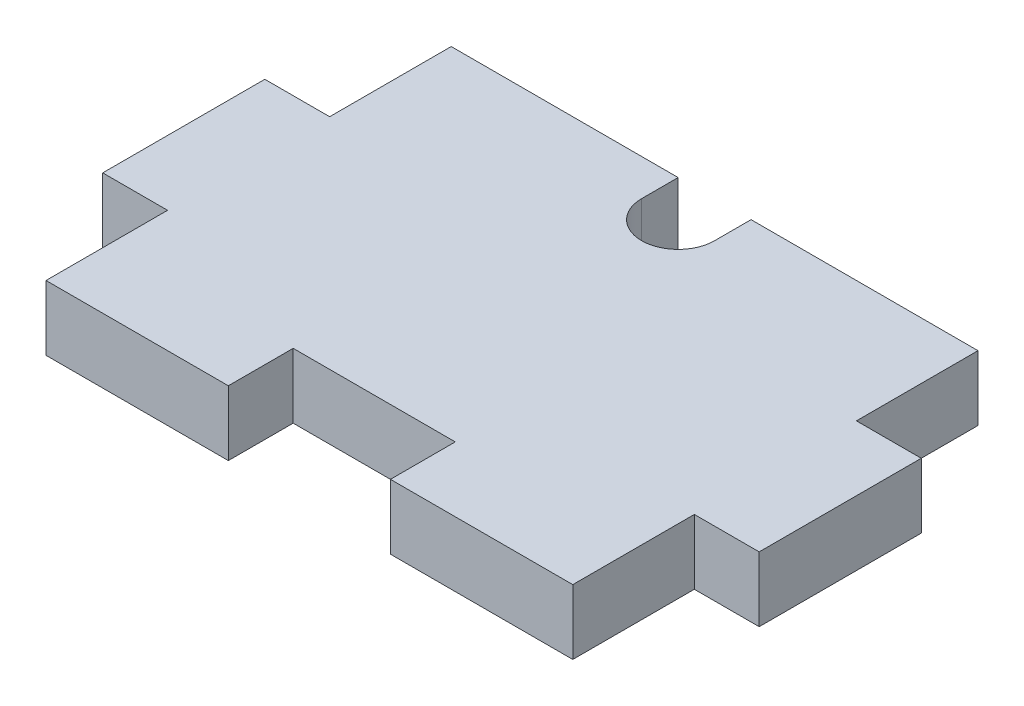
ISO-10303-21;
HEADER;
FILE_DESCRIPTION(('STEP AP214'),'2;1');
FILE_NAME('part.step','',(''),(''),'','','');
FILE_SCHEMA(('AUTOMOTIVE_DESIGN { 1 0 10303 214 1 1 1 1 }'));
ENDSEC;
DATA;
#1=APPLICATION_CONTEXT('core data for automotive mechanical design processes');
#2=APPLICATION_PROTOCOL_DEFINITION('international standard','automotive_design',2000,#1);
#3=PRODUCT_CONTEXT('',#1,'mechanical');
#4=PRODUCT('Part','Part','',(#3));
#5=PRODUCT_RELATED_PRODUCT_CATEGORY('part','',(#4));
#6=PRODUCT_DEFINITION_FORMATION('','',#4);
#7=PRODUCT_DEFINITION_CONTEXT('part definition',#1,'design');
#8=PRODUCT_DEFINITION('design','',#6,#7);
#9=PRODUCT_DEFINITION_SHAPE('','',#8);
#10=(LENGTH_UNIT() NAMED_UNIT(*) SI_UNIT(.MILLI.,.METRE.));
#11=(NAMED_UNIT(*) PLANE_ANGLE_UNIT() SI_UNIT($,.RADIAN.));
#12=(NAMED_UNIT(*) SI_UNIT($,.STERADIAN.) SOLID_ANGLE_UNIT());
#13=UNCERTAINTY_MEASURE_WITH_UNIT(LENGTH_MEASURE(1.E-05),#10,'distance_accuracy_value','');
#14=(GEOMETRIC_REPRESENTATION_CONTEXT(3) GLOBAL_UNCERTAINTY_ASSIGNED_CONTEXT((#13)) GLOBAL_UNIT_ASSIGNED_CONTEXT((#10,
#11,#12)) REPRESENTATION_CONTEXT('',''));
#15=CARTESIAN_POINT('',(0.,0.,0.));
#16=DIRECTION('',(0.,0.,1.));
#17=DIRECTION('',(1.,0.,0.));
#18=AXIS2_PLACEMENT_3D('',#15,#16,#17);
#19=CARTESIAN_POINT('',(0.,4.,25.));
#20=DIRECTION('',(0.,0.,-1.));
#21=DIRECTION('',(-1.,0.,0.));
#22=AXIS2_PLACEMENT_3D('',#19,#20,#21);
#23=PLANE('',#22);
#24=DIRECTION('',(1.,0.,0.));
#25=VECTOR('',#24,1.);
#26=CARTESIAN_POINT('',(0.,0.,25.));
#27=LINE('',#26,#25);
#28=CARTESIAN_POINT('',(0.,0.,25.));
#29=VERTEX_POINT('',#28);
#30=CARTESIAN_POINT('',(11.25,0.,25.));
#31=VERTEX_POINT('',#30);
#32=EDGE_CURVE('E188',#29,#31,#27,.T.);
#33=ORIENTED_EDGE('',*,*,#32,.T.);
#34=DIRECTION('',(0.,1.,0.));
#35=VECTOR('',#34,1.);
#36=CARTESIAN_POINT('',(11.25,0.,25.));
#37=LINE('',#36,#35);
#38=CARTESIAN_POINT('',(11.25,4.,25.));
#39=VERTEX_POINT('',#38);
#40=EDGE_CURVE('E170',#31,#39,#37,.T.);
#41=ORIENTED_EDGE('',*,*,#40,.T.);
#42=DIRECTION('',(1.,0.,0.));
#43=VECTOR('',#42,1.);
#44=CARTESIAN_POINT('',(0.,4.,25.));
#45=LINE('',#44,#43);
#46=CARTESIAN_POINT('',(0.,4.,25.));
#47=VERTEX_POINT('',#46);
#48=EDGE_CURVE('E309',#47,#39,#45,.T.);
#49=ORIENTED_EDGE('',*,*,#48,.F.);
#50=DIRECTION('',(0.,-1.,0.));
#51=VECTOR('',#50,1.);
#52=CARTESIAN_POINT('',(0.,4.,25.));
#53=LINE('',#52,#51);
#54=EDGE_CURVE('E11',#47,#29,#53,.T.);
#55=ORIENTED_EDGE('',*,*,#54,.T.);
#56=EDGE_LOOP('',(#33,#41,#49,#55));
#57=FACE_BOUND('',#56,.T.);
#58=ADVANCED_FACE('F33',(#57),#23,.F.);
#59=CARTESIAN_POINT('',(32.5,4.,0.));
#60=DIRECTION('',(-1.,0.,0.));
#61=DIRECTION('',(0.,0.,1.));
#62=AXIS2_PLACEMENT_3D('',#59,#60,#61);
#63=PLANE('',#62);
#64=DIRECTION('',(0.,1.,0.));
#65=VECTOR('',#64,1.);
#66=CARTESIAN_POINT('',(32.5,0.,7.5));
#67=LINE('',#66,#65);
#68=CARTESIAN_POINT('',(32.5,0.,7.5));
#69=VERTEX_POINT('',#68);
#70=CARTESIAN_POINT('',(32.5,4.,7.5));
#71=VERTEX_POINT('',#70);
#72=EDGE_CURVE('E235',#69,#71,#67,.T.);
#73=ORIENTED_EDGE('',*,*,#72,.F.);
#74=DIRECTION('',(0.,0.,-1.));
#75=VECTOR('',#74,1.);
#76=CARTESIAN_POINT('',(32.5,0.,0.));
#77=LINE('',#76,#75);
#78=CARTESIAN_POINT('',(32.5,0.,0.));
#79=VERTEX_POINT('',#78);
#80=EDGE_CURVE('E193',#69,#79,#77,.T.);
#81=ORIENTED_EDGE('',*,*,#80,.T.);
#82=DIRECTION('',(0.,-1.,0.));
#83=VECTOR('',#82,1.);
#84=CARTESIAN_POINT('',(32.5,4.,0.));
#85=LINE('',#84,#83);
#86=CARTESIAN_POINT('',(32.5,4.,0.));
#87=VERTEX_POINT('',#86);
#88=EDGE_CURVE('E211',#87,#79,#85,.T.);
#89=ORIENTED_EDGE('',*,*,#88,.F.);
#90=DIRECTION('',(0.,0.,-1.));
#91=VECTOR('',#90,1.);
#92=CARTESIAN_POINT('',(32.5,4.,0.));
#93=LINE('',#92,#91);
#94=EDGE_CURVE('E311',#71,#87,#93,.T.);
#95=ORIENTED_EDGE('',*,*,#94,.F.);
#96=EDGE_LOOP('',(#73,#81,#89,#95));
#97=FACE_BOUND('',#96,.T.);
#98=ADVANCED_FACE('F376',(#97),#63,.F.);
#99=CARTESIAN_POINT('',(0.,4.,0.));
#100=DIRECTION('',(1.,0.,0.));
#101=DIRECTION('',(0.,0.,-1.));
#102=AXIS2_PLACEMENT_3D('',#99,#100,#101);
#103=PLANE('',#102);
#104=DIRECTION('',(0.,1.,0.));
#105=VECTOR('',#104,1.);
#106=CARTESIAN_POINT('',(0.,0.,17.5));
#107=LINE('',#106,#105);
#108=CARTESIAN_POINT('',(0.,0.,17.5));
#109=VERTEX_POINT('',#108);
#110=CARTESIAN_POINT('',(0.,4.,17.5));
#111=VERTEX_POINT('',#110);
#112=EDGE_CURVE('E271',#109,#111,#107,.T.);
#113=ORIENTED_EDGE('',*,*,#112,.F.);
#114=DIRECTION('',(0.,0.,1.));
#115=VECTOR('',#114,1.);
#116=CARTESIAN_POINT('',(0.,0.,0.));
#117=LINE('',#116,#115);
#118=EDGE_CURVE('E298',#109,#29,#117,.T.);
#119=ORIENTED_EDGE('',*,*,#118,.T.);
#120=ORIENTED_EDGE('',*,*,#54,.F.);
#121=DIRECTION('',(0.,0.,1.));
#122=VECTOR('',#121,1.);
#123=CARTESIAN_POINT('',(0.,4.,0.));
#124=LINE('',#123,#122);
#125=EDGE_CURVE('E207',#111,#47,#124,.T.);
#126=ORIENTED_EDGE('',*,*,#125,.F.);
#127=EDGE_LOOP('',(#113,#119,#120,#126));
#128=FACE_BOUND('',#127,.T.);
#129=ADVANCED_FACE('F344',(#128),#103,.F.);
#130=CARTESIAN_POINT('',(0.,4.,0.));
#131=DIRECTION('',(0.,0.,1.));
#132=DIRECTION('',(1.,0.,0.));
#133=AXIS2_PLACEMENT_3D('',#130,#131,#132);
#134=PLANE('',#133);
#135=DIRECTION('',(0.,1.,0.));
#136=VECTOR('',#135,1.);
#137=CARTESIAN_POINT('',(14.,0.,0.));
#138=LINE('',#137,#136);
#139=CARTESIAN_POINT('',(14.,0.,0.));
#140=VERTEX_POINT('',#139);
#141=CARTESIAN_POINT('',(14.,4.,0.));
#142=VERTEX_POINT('',#141);
#143=EDGE_CURVE('E299',#140,#142,#138,.T.);
#144=ORIENTED_EDGE('',*,*,#143,.F.);
#145=DIRECTION('',(-1.,0.,0.));
#146=VECTOR('',#145,1.);
#147=CARTESIAN_POINT('',(0.,0.,0.));
#148=LINE('',#147,#146);
#149=CARTESIAN_POINT('',(0.,0.,0.));
#150=VERTEX_POINT('',#149);
#151=EDGE_CURVE('E203',#140,#150,#148,.T.);
#152=ORIENTED_EDGE('',*,*,#151,.T.);
#153=DIRECTION('',(0.,-1.,0.));
#154=VECTOR('',#153,1.);
#155=CARTESIAN_POINT('',(0.,4.,0.));
#156=LINE('',#155,#154);
#157=CARTESIAN_POINT('',(0.,4.,0.));
#158=VERTEX_POINT('',#157);
#159=EDGE_CURVE('E208',#158,#150,#156,.T.);
#160=ORIENTED_EDGE('',*,*,#159,.F.);
#161=DIRECTION('',(-1.,0.,0.));
#162=VECTOR('',#161,1.);
#163=CARTESIAN_POINT('',(0.,4.,0.));
#164=LINE('',#163,#162);
#165=EDGE_CURVE('E312',#142,#158,#164,.T.);
#166=ORIENTED_EDGE('',*,*,#165,.F.);
#167=EDGE_LOOP('',(#144,#152,#160,#166));
#168=FACE_BOUND('',#167,.T.);
#169=ADVANCED_FACE('F325',(#168),#134,.F.);
#170=CARTESIAN_POINT('',(0.,4.,0.));
#171=DIRECTION('',(0.,1.,0.));
#172=DIRECTION('',(0.,0.,1.));
#173=AXIS2_PLACEMENT_3D('',#170,#171,#172);
#174=PLANE('',#173);
#175=DIRECTION('',(0.,0.,1.));
#176=VECTOR('',#175,1.);
#177=CARTESIAN_POINT('',(11.25,4.,21.));
#178=LINE('',#177,#176);
#179=CARTESIAN_POINT('',(11.25,4.,21.));
#180=VERTEX_POINT('',#179);
#181=EDGE_CURVE('E176',#180,#39,#178,.T.);
#182=ORIENTED_EDGE('',*,*,#181,.F.);
#183=DIRECTION('',(-1.,0.,0.));
#184=VECTOR('',#183,1.);
#185=CARTESIAN_POINT('',(11.25,4.,21.));
#186=LINE('',#185,#184);
#187=CARTESIAN_POINT('',(21.25,4.,21.));
#188=VERTEX_POINT('',#187);
#189=EDGE_CURVE('E190',#188,#180,#186,.T.);
#190=ORIENTED_EDGE('',*,*,#189,.F.);
#191=DIRECTION('',(0.,0.,-1.));
#192=VECTOR('',#191,1.);
#193=CARTESIAN_POINT('',(21.25,4.,21.));
#194=LINE('',#193,#192);
#195=CARTESIAN_POINT('',(21.25,4.,25.));
#196=VERTEX_POINT('',#195);
#197=EDGE_CURVE('E348',#196,#188,#194,.T.);
#198=ORIENTED_EDGE('',*,*,#197,.F.);
#199=CARTESIAN_POINT('',(32.5,4.,25.));
#200=VERTEX_POINT('',#199);
#201=EDGE_CURVE('E308',#196,#200,#45,.T.);
#202=ORIENTED_EDGE('',*,*,#201,.T.);
#203=CARTESIAN_POINT('',(32.5,4.,17.5));
#204=VERTEX_POINT('',#203);
#205=EDGE_CURVE('E221',#200,#204,#93,.T.);
#206=ORIENTED_EDGE('',*,*,#205,.T.);
#207=DIRECTION('',(1.,0.,0.));
#208=VECTOR('',#207,1.);
#209=CARTESIAN_POINT('',(32.5,4.,17.5));
#210=LINE('',#209,#208);
#211=CARTESIAN_POINT('',(36.5,4.,17.5));
#212=VERTEX_POINT('',#211);
#213=EDGE_CURVE('E56',#204,#212,#210,.T.);
#214=ORIENTED_EDGE('',*,*,#213,.T.);
#215=DIRECTION('',(0.,0.,-1.));
#216=VECTOR('',#215,1.);
#217=CARTESIAN_POINT('',(36.5,4.,7.5));
#218=LINE('',#217,#216);
#219=CARTESIAN_POINT('',(36.5,4.,7.5));
#220=VERTEX_POINT('',#219);
#221=EDGE_CURVE('E240',#212,#220,#218,.T.);
#222=ORIENTED_EDGE('',*,*,#221,.T.);
#223=DIRECTION('',(-1.,0.,0.));
#224=VECTOR('',#223,1.);
#225=CARTESIAN_POINT('',(32.5,4.,7.5));
#226=LINE('',#225,#224);
#227=EDGE_CURVE('E243',#220,#71,#226,.T.);
#228=ORIENTED_EDGE('',*,*,#227,.T.);
#229=ORIENTED_EDGE('',*,*,#94,.T.);
#230=CARTESIAN_POINT('',(18.5,4.,0.));
#231=VERTEX_POINT('',#230);
#232=EDGE_CURVE('E212',#87,#231,#164,.T.);
#233=ORIENTED_EDGE('',*,*,#232,.T.);
#234=DIRECTION('',(0.,0.,-1.));
#235=VECTOR('',#234,1.);
#236=CARTESIAN_POINT('',(18.5,4.,0.));
#237=LINE('',#236,#235);
#238=CARTESIAN_POINT('',(18.5,4.,2.25));
#239=VERTEX_POINT('',#238);
#240=EDGE_CURVE('E292',#239,#231,#237,.T.);
#241=ORIENTED_EDGE('',*,*,#240,.F.);
#242=CARTESIAN_POINT('',(16.25,4.,2.25));
#243=DIRECTION('',(0.,1.,0.));
#244=DIRECTION('',(0.,0.,1.));
#245=AXIS2_PLACEMENT_3D('',#242,#243,#244);
#246=CIRCLE('',#245,2.25);
#247=CARTESIAN_POINT('',(14.,4.,2.25));
#248=VERTEX_POINT('',#247);
#249=EDGE_CURVE('E273',#248,#239,#246,.T.);
#250=ORIENTED_EDGE('',*,*,#249,.F.);
#251=DIRECTION('',(0.,0.,-1.));
#252=VECTOR('',#251,1.);
#253=CARTESIAN_POINT('',(14.,4.,0.));
#254=LINE('',#253,#252);
#255=EDGE_CURVE('E284',#248,#142,#254,.T.);
#256=ORIENTED_EDGE('',*,*,#255,.T.);
#257=ORIENTED_EDGE('',*,*,#165,.T.);
#258=CARTESIAN_POINT('',(0.,4.,7.5));
#259=VERTEX_POINT('',#258);
#260=EDGE_CURVE('E305',#158,#259,#124,.T.);
#261=ORIENTED_EDGE('',*,*,#260,.T.);
#262=DIRECTION('',(-1.,0.,0.));
#263=VECTOR('',#262,1.);
#264=CARTESIAN_POINT('',(-4.,4.,7.5));
#265=LINE('',#264,#263);
#266=CARTESIAN_POINT('',(-4.,4.,7.5));
#267=VERTEX_POINT('',#266);
#268=EDGE_CURVE('E250',#259,#267,#265,.T.);
#269=ORIENTED_EDGE('',*,*,#268,.T.);
#270=DIRECTION('',(0.,0.,1.));
#271=VECTOR('',#270,1.);
#272=CARTESIAN_POINT('',(-4.,4.,7.5));
#273=LINE('',#272,#271);
#274=CARTESIAN_POINT('',(-4.,4.,17.5));
#275=VERTEX_POINT('',#274);
#276=EDGE_CURVE('E266',#267,#275,#273,.T.);
#277=ORIENTED_EDGE('',*,*,#276,.T.);
#278=DIRECTION('',(1.,0.,0.));
#279=VECTOR('',#278,1.);
#280=CARTESIAN_POINT('',(-4.,4.,17.5));
#281=LINE('',#280,#279);
#282=EDGE_CURVE('E258',#275,#111,#281,.T.);
#283=ORIENTED_EDGE('',*,*,#282,.T.);
#284=ORIENTED_EDGE('',*,*,#125,.T.);
#285=ORIENTED_EDGE('',*,*,#48,.T.);
#286=EDGE_LOOP('',(#182,#190,#198,#202,#206,#214,#222,#228,#229,#233,#241,#250,#256,#257,#261,
#269,#277,#283,#284,#285));
#287=FACE_BOUND('',#286,.T.);
#288=ADVANCED_FACE('F319',(#287),#174,.T.);
#289=CARTESIAN_POINT('',(0.,0.,0.));
#290=DIRECTION('',(0.,1.,0.));
#291=DIRECTION('',(0.,0.,1.));
#292=AXIS2_PLACEMENT_3D('',#289,#290,#291);
#293=PLANE('',#292);
#294=DIRECTION('',(-1.,0.,0.));
#295=VECTOR('',#294,1.);
#296=CARTESIAN_POINT('',(11.25,0.,21.));
#297=LINE('',#296,#295);
#298=CARTESIAN_POINT('',(21.25,0.,21.));
#299=VERTEX_POINT('',#298);
#300=CARTESIAN_POINT('',(11.25,0.,21.));
#301=VERTEX_POINT('',#300);
#302=EDGE_CURVE('E182',#299,#301,#297,.T.);
#303=ORIENTED_EDGE('',*,*,#302,.T.);
#304=DIRECTION('',(0.,0.,1.));
#305=VECTOR('',#304,1.);
#306=CARTESIAN_POINT('',(11.25,0.,21.));
#307=LINE('',#306,#305);
#308=EDGE_CURVE('E173',#301,#31,#307,.T.);
#309=ORIENTED_EDGE('',*,*,#308,.T.);
#310=ORIENTED_EDGE('',*,*,#32,.F.);
#311=ORIENTED_EDGE('',*,*,#118,.F.);
#312=DIRECTION('',(1.,0.,0.));
#313=VECTOR('',#312,1.);
#314=CARTESIAN_POINT('',(-4.,0.,17.5));
#315=LINE('',#314,#313);
#316=CARTESIAN_POINT('',(-4.,0.,17.5));
#317=VERTEX_POINT('',#316);
#318=EDGE_CURVE('E261',#317,#109,#315,.T.);
#319=ORIENTED_EDGE('',*,*,#318,.F.);
#320=DIRECTION('',(0.,0.,1.));
#321=VECTOR('',#320,1.);
#322=CARTESIAN_POINT('',(-4.,0.,7.5));
#323=LINE('',#322,#321);
#324=CARTESIAN_POINT('',(-4.,0.,7.5));
#325=VERTEX_POINT('',#324);
#326=EDGE_CURVE('E257',#325,#317,#323,.T.);
#327=ORIENTED_EDGE('',*,*,#326,.F.);
#328=DIRECTION('',(-1.,0.,0.));
#329=VECTOR('',#328,1.);
#330=CARTESIAN_POINT('',(-4.,0.,7.5));
#331=LINE('',#330,#329);
#332=CARTESIAN_POINT('',(0.,0.,7.5));
#333=VERTEX_POINT('',#332);
#334=EDGE_CURVE('E254',#333,#325,#331,.T.);
#335=ORIENTED_EDGE('',*,*,#334,.F.);
#336=EDGE_CURVE('E198',#150,#333,#117,.T.);
#337=ORIENTED_EDGE('',*,*,#336,.F.);
#338=ORIENTED_EDGE('',*,*,#151,.F.);
#339=DIRECTION('',(0.,0.,-1.));
#340=VECTOR('',#339,1.);
#341=CARTESIAN_POINT('',(14.,0.,0.));
#342=LINE('',#341,#340);
#343=CARTESIAN_POINT('',(14.,0.,2.25));
#344=VERTEX_POINT('',#343);
#345=EDGE_CURVE('E287',#344,#140,#342,.T.);
#346=ORIENTED_EDGE('',*,*,#345,.F.);
#347=CARTESIAN_POINT('',(16.25,0.,2.25));
#348=DIRECTION('',(0.,1.,0.));
#349=DIRECTION('',(0.,0.,1.));
#350=AXIS2_PLACEMENT_3D('',#347,#348,#349);
#351=CIRCLE('',#350,2.25);
#352=CARTESIAN_POINT('',(18.5,0.,2.25));
#353=VERTEX_POINT('',#352);
#354=EDGE_CURVE('E280',#344,#353,#351,.T.);
#355=ORIENTED_EDGE('',*,*,#354,.T.);
#356=DIRECTION('',(0.,0.,-1.));
#357=VECTOR('',#356,1.);
#358=CARTESIAN_POINT('',(18.5,0.,0.));
#359=LINE('',#358,#357);
#360=CARTESIAN_POINT('',(18.5,0.,0.));
#361=VERTEX_POINT('',#360);
#362=EDGE_CURVE('E283',#353,#361,#359,.T.);
#363=ORIENTED_EDGE('',*,*,#362,.T.);
#364=EDGE_CURVE('E204',#79,#361,#148,.T.);
#365=ORIENTED_EDGE('',*,*,#364,.F.);
#366=ORIENTED_EDGE('',*,*,#80,.F.);
#367=DIRECTION('',(-1.,0.,0.));
#368=VECTOR('',#367,1.);
#369=CARTESIAN_POINT('',(32.5,0.,7.5));
#370=LINE('',#369,#368);
#371=CARTESIAN_POINT('',(36.5,0.,7.5));
#372=VERTEX_POINT('',#371);
#373=EDGE_CURVE('E233',#372,#69,#370,.T.);
#374=ORIENTED_EDGE('',*,*,#373,.F.);
#375=DIRECTION('',(0.,0.,-1.));
#376=VECTOR('',#375,1.);
#377=CARTESIAN_POINT('',(36.5,0.,7.5));
#378=LINE('',#377,#376);
#379=CARTESIAN_POINT('',(36.5,0.,17.5));
#380=VERTEX_POINT('',#379);
#381=EDGE_CURVE('E231',#380,#372,#378,.T.);
#382=ORIENTED_EDGE('',*,*,#381,.F.);
#383=DIRECTION('',(1.,0.,0.));
#384=VECTOR('',#383,1.);
#385=CARTESIAN_POINT('',(32.5,0.,17.5));
#386=LINE('',#385,#384);
#387=CARTESIAN_POINT('',(32.5,0.,17.5));
#388=VERTEX_POINT('',#387);
#389=EDGE_CURVE('E228',#388,#380,#386,.T.);
#390=ORIENTED_EDGE('',*,*,#389,.F.);
#391=CARTESIAN_POINT('',(32.5,0.,25.));
#392=VERTEX_POINT('',#391);
#393=EDGE_CURVE('E196',#392,#388,#77,.T.);
#394=ORIENTED_EDGE('',*,*,#393,.F.);
#395=CARTESIAN_POINT('',(21.25,0.,25.));
#396=VERTEX_POINT('',#395);
#397=EDGE_CURVE('E194',#396,#392,#27,.T.);
#398=ORIENTED_EDGE('',*,*,#397,.F.);
#399=DIRECTION('',(0.,0.,-1.));
#400=VECTOR('',#399,1.);
#401=CARTESIAN_POINT('',(21.25,0.,21.));
#402=LINE('',#401,#400);
#403=EDGE_CURVE('E48',#396,#299,#402,.T.);
#404=ORIENTED_EDGE('',*,*,#403,.T.);
#405=EDGE_LOOP('',(#303,#309,#310,#311,#319,#327,#335,#337,#338,#346,#355,#363,#365,#366,#374,
#382,#390,#394,#398,#404));
#406=FACE_BOUND('',#405,.T.);
#407=ADVANCED_FACE('F186',(#406),#293,.F.);
#408=ORIENTED_EDGE('',*,*,#336,.T.);
#409=DIRECTION('',(0.,1.,0.));
#410=VECTOR('',#409,1.);
#411=CARTESIAN_POINT('',(0.,0.,7.5));
#412=LINE('',#411,#410);
#413=EDGE_CURVE('E263',#333,#259,#412,.T.);
#414=ORIENTED_EDGE('',*,*,#413,.T.);
#415=ORIENTED_EDGE('',*,*,#260,.F.);
#416=ORIENTED_EDGE('',*,*,#159,.T.);
#417=EDGE_LOOP('',(#408,#414,#415,#416));
#418=FACE_BOUND('',#417,.T.);
#419=ADVANCED_FACE('F35',(#418),#103,.F.);
#420=ORIENTED_EDGE('',*,*,#201,.F.);
#421=DIRECTION('',(0.,1.,0.));
#422=VECTOR('',#421,1.);
#423=CARTESIAN_POINT('',(21.25,0.,25.));
#424=LINE('',#423,#422);
#425=EDGE_CURVE('E181',#396,#196,#424,.T.);
#426=ORIENTED_EDGE('',*,*,#425,.F.);
#427=ORIENTED_EDGE('',*,*,#397,.T.);
#428=DIRECTION('',(0.,-1.,0.));
#429=VECTOR('',#428,1.);
#430=CARTESIAN_POINT('',(32.5,4.,25.));
#431=LINE('',#430,#429);
#432=EDGE_CURVE('E41',#200,#392,#431,.T.);
#433=ORIENTED_EDGE('',*,*,#432,.F.);
#434=EDGE_LOOP('',(#420,#426,#427,#433));
#435=FACE_BOUND('',#434,.T.);
#436=ADVANCED_FACE('F377',(#435),#23,.F.);
#437=ORIENTED_EDGE('',*,*,#393,.T.);
#438=DIRECTION('',(0.,1.,0.));
#439=VECTOR('',#438,1.);
#440=CARTESIAN_POINT('',(32.5,0.,17.5));
#441=LINE('',#440,#439);
#442=EDGE_CURVE('E251',#388,#204,#441,.T.);
#443=ORIENTED_EDGE('',*,*,#442,.T.);
#444=ORIENTED_EDGE('',*,*,#205,.F.);
#445=ORIENTED_EDGE('',*,*,#432,.T.);
#446=EDGE_LOOP('',(#437,#443,#444,#445));
#447=FACE_BOUND('',#446,.T.);
#448=ADVANCED_FACE('F219',(#447),#63,.F.);
#449=ORIENTED_EDGE('',*,*,#364,.T.);
#450=DIRECTION('',(0.,1.,0.));
#451=VECTOR('',#450,1.);
#452=CARTESIAN_POINT('',(18.5,0.,0.));
#453=LINE('',#452,#451);
#454=EDGE_CURVE('E301',#361,#231,#453,.T.);
#455=ORIENTED_EDGE('',*,*,#454,.T.);
#456=ORIENTED_EDGE('',*,*,#232,.F.);
#457=ORIENTED_EDGE('',*,*,#88,.T.);
#458=EDGE_LOOP('',(#449,#455,#456,#457));
#459=FACE_BOUND('',#458,.T.);
#460=ADVANCED_FACE('F391',(#459),#134,.F.);
#461=CARTESIAN_POINT('',(16.25,0.,2.25));
#462=DIRECTION('',(0.,1.,0.));
#463=DIRECTION('',(0.,0.,1.));
#464=AXIS2_PLACEMENT_3D('',#461,#462,#463);
#465=CYLINDRICAL_SURFACE('',#464,2.25);
#466=ORIENTED_EDGE('',*,*,#249,.T.);
#467=DIRECTION('',(0.,1.,0.));
#468=VECTOR('',#467,1.);
#469=CARTESIAN_POINT('',(18.5,0.,2.25));
#470=LINE('',#469,#468);
#471=EDGE_CURVE('E289',#353,#239,#470,.T.);
#472=ORIENTED_EDGE('',*,*,#471,.F.);
#473=ORIENTED_EDGE('',*,*,#354,.F.);
#474=DIRECTION('',(0.,1.,0.));
#475=VECTOR('',#474,1.);
#476=CARTESIAN_POINT('',(14.,0.,2.25));
#477=LINE('',#476,#475);
#478=EDGE_CURVE('E296',#344,#248,#477,.T.);
#479=ORIENTED_EDGE('',*,*,#478,.T.);
#480=EDGE_LOOP('',(#466,#472,#473,#479));
#481=FACE_BOUND('',#480,.T.);
#482=ADVANCED_FACE('F482',(#481),#465,.F.);
#483=CARTESIAN_POINT('',(14.,0.,0.));
#484=DIRECTION('',(1.,0.,0.));
#485=DIRECTION('',(0.,0.,-1.));
#486=AXIS2_PLACEMENT_3D('',#483,#484,#485);
#487=PLANE('',#486);
#488=ORIENTED_EDGE('',*,*,#255,.F.);
#489=ORIENTED_EDGE('',*,*,#478,.F.);
#490=ORIENTED_EDGE('',*,*,#345,.T.);
#491=ORIENTED_EDGE('',*,*,#143,.T.);
#492=EDGE_LOOP('',(#488,#489,#490,#491));
#493=FACE_BOUND('',#492,.T.);
#494=ADVANCED_FACE('F472',(#493),#487,.T.);
#495=CARTESIAN_POINT('',(18.5,0.,0.));
#496=DIRECTION('',(1.,0.,0.));
#497=DIRECTION('',(0.,0.,-1.));
#498=AXIS2_PLACEMENT_3D('',#495,#496,#497);
#499=PLANE('',#498);
#500=ORIENTED_EDGE('',*,*,#240,.T.);
#501=ORIENTED_EDGE('',*,*,#454,.F.);
#502=ORIENTED_EDGE('',*,*,#362,.F.);
#503=ORIENTED_EDGE('',*,*,#471,.T.);
#504=EDGE_LOOP('',(#500,#501,#502,#503));
#505=FACE_BOUND('',#504,.T.);
#506=ADVANCED_FACE('F441',(#505),#499,.F.);
#507=CARTESIAN_POINT('',(-4.,0.,17.5));
#508=DIRECTION('',(0.,0.,1.));
#509=DIRECTION('',(1.,0.,0.));
#510=AXIS2_PLACEMENT_3D('',#507,#508,#509);
#511=PLANE('',#510);
#512=ORIENTED_EDGE('',*,*,#282,.F.);
#513=DIRECTION('',(0.,1.,0.));
#514=VECTOR('',#513,1.);
#515=CARTESIAN_POINT('',(-4.,0.,17.5));
#516=LINE('',#515,#514);
#517=EDGE_CURVE('E274',#317,#275,#516,.T.);
#518=ORIENTED_EDGE('',*,*,#517,.F.);
#519=ORIENTED_EDGE('',*,*,#318,.T.);
#520=ORIENTED_EDGE('',*,*,#112,.T.);
#521=EDGE_LOOP('',(#512,#518,#519,#520));
#522=FACE_BOUND('',#521,.T.);
#523=ADVANCED_FACE('F341',(#522),#511,.T.);
#524=CARTESIAN_POINT('',(-4.,0.,7.5));
#525=DIRECTION('',(-1.,0.,0.));
#526=DIRECTION('',(0.,0.,1.));
#527=AXIS2_PLACEMENT_3D('',#524,#525,#526);
#528=PLANE('',#527);
#529=ORIENTED_EDGE('',*,*,#276,.F.);
#530=DIRECTION('',(0.,1.,0.));
#531=VECTOR('',#530,1.);
#532=CARTESIAN_POINT('',(-4.,0.,7.5));
#533=LINE('',#532,#531);
#534=EDGE_CURVE('E276',#325,#267,#533,.T.);
#535=ORIENTED_EDGE('',*,*,#534,.F.);
#536=ORIENTED_EDGE('',*,*,#326,.T.);
#537=ORIENTED_EDGE('',*,*,#517,.T.);
#538=EDGE_LOOP('',(#529,#535,#536,#537));
#539=FACE_BOUND('',#538,.T.);
#540=ADVANCED_FACE('F337',(#539),#528,.T.);
#541=CARTESIAN_POINT('',(-4.,0.,7.5));
#542=DIRECTION('',(0.,0.,-1.));
#543=DIRECTION('',(-1.,0.,0.));
#544=AXIS2_PLACEMENT_3D('',#541,#542,#543);
#545=PLANE('',#544);
#546=ORIENTED_EDGE('',*,*,#268,.F.);
#547=ORIENTED_EDGE('',*,*,#413,.F.);
#548=ORIENTED_EDGE('',*,*,#334,.T.);
#549=ORIENTED_EDGE('',*,*,#534,.T.);
#550=EDGE_LOOP('',(#546,#547,#548,#549));
#551=FACE_BOUND('',#550,.T.);
#552=ADVANCED_FACE('F332',(#551),#545,.T.);
#553=CARTESIAN_POINT('',(36.5,0.,7.5));
#554=DIRECTION('',(1.,0.,0.));
#555=DIRECTION('',(0.,0.,-1.));
#556=AXIS2_PLACEMENT_3D('',#553,#554,#555);
#557=PLANE('',#556);
#558=ORIENTED_EDGE('',*,*,#221,.F.);
#559=DIRECTION('',(0.,1.,0.));
#560=VECTOR('',#559,1.);
#561=CARTESIAN_POINT('',(36.5,0.,17.5));
#562=LINE('',#561,#560);
#563=EDGE_CURVE('E248',#380,#212,#562,.T.);
#564=ORIENTED_EDGE('',*,*,#563,.F.);
#565=ORIENTED_EDGE('',*,*,#381,.T.);
#566=DIRECTION('',(0.,1.,0.));
#567=VECTOR('',#566,1.);
#568=CARTESIAN_POINT('',(36.5,0.,7.5));
#569=LINE('',#568,#567);
#570=EDGE_CURVE('E232',#372,#220,#569,.T.);
#571=ORIENTED_EDGE('',*,*,#570,.T.);
#572=EDGE_LOOP('',(#558,#564,#565,#571));
#573=FACE_BOUND('',#572,.T.);
#574=ADVANCED_FACE('F361',(#573),#557,.T.);
#575=CARTESIAN_POINT('',(32.5,0.,17.5));
#576=DIRECTION('',(0.,0.,1.));
#577=DIRECTION('',(1.,0.,0.));
#578=AXIS2_PLACEMENT_3D('',#575,#576,#577);
#579=PLANE('',#578);
#580=ORIENTED_EDGE('',*,*,#213,.F.);
#581=ORIENTED_EDGE('',*,*,#442,.F.);
#582=ORIENTED_EDGE('',*,*,#389,.T.);
#583=ORIENTED_EDGE('',*,*,#563,.T.);
#584=EDGE_LOOP('',(#580,#581,#582,#583));
#585=FACE_BOUND('',#584,.T.);
#586=ADVANCED_FACE('F363',(#585),#579,.T.);
#587=CARTESIAN_POINT('',(32.5,0.,7.5));
#588=DIRECTION('',(0.,0.,-1.));
#589=DIRECTION('',(-1.,0.,0.));
#590=AXIS2_PLACEMENT_3D('',#587,#588,#589);
#591=PLANE('',#590);
#592=ORIENTED_EDGE('',*,*,#227,.F.);
#593=ORIENTED_EDGE('',*,*,#570,.F.);
#594=ORIENTED_EDGE('',*,*,#373,.T.);
#595=ORIENTED_EDGE('',*,*,#72,.T.);
#596=EDGE_LOOP('',(#592,#593,#594,#595));
#597=FACE_BOUND('',#596,.T.);
#598=ADVANCED_FACE('F365',(#597),#591,.T.);
#599=CARTESIAN_POINT('',(11.25,0.,21.));
#600=DIRECTION('',(-1.,0.,0.));
#601=DIRECTION('',(0.,0.,1.));
#602=AXIS2_PLACEMENT_3D('',#599,#600,#601);
#603=PLANE('',#602);
#604=ORIENTED_EDGE('',*,*,#181,.T.);
#605=ORIENTED_EDGE('',*,*,#40,.F.);
#606=ORIENTED_EDGE('',*,*,#308,.F.);
#607=DIRECTION('',(0.,1.,0.));
#608=VECTOR('',#607,1.);
#609=CARTESIAN_POINT('',(11.25,0.,21.));
#610=LINE('',#609,#608);
#611=EDGE_CURVE('E244',#301,#180,#610,.T.);
#612=ORIENTED_EDGE('',*,*,#611,.T.);
#613=EDGE_LOOP('',(#604,#605,#606,#612));
#614=FACE_BOUND('',#613,.T.);
#615=ADVANCED_FACE('F172',(#614),#603,.F.);
#616=CARTESIAN_POINT('',(11.25,0.,21.));
#617=DIRECTION('',(0.,0.,-1.));
#618=DIRECTION('',(-1.,0.,0.));
#619=AXIS2_PLACEMENT_3D('',#616,#617,#618);
#620=PLANE('',#619);
#621=ORIENTED_EDGE('',*,*,#189,.T.);
#622=ORIENTED_EDGE('',*,*,#611,.F.);
#623=ORIENTED_EDGE('',*,*,#302,.F.);
#624=DIRECTION('',(0.,1.,0.));
#625=VECTOR('',#624,1.);
#626=CARTESIAN_POINT('',(21.25,0.,21.));
#627=LINE('',#626,#625);
#628=EDGE_CURVE('E357',#299,#188,#627,.T.);
#629=ORIENTED_EDGE('',*,*,#628,.T.);
#630=EDGE_LOOP('',(#621,#622,#623,#629));
#631=FACE_BOUND('',#630,.T.);
#632=ADVANCED_FACE('F395',(#631),#620,.F.);
#633=CARTESIAN_POINT('',(21.25,0.,21.));
#634=DIRECTION('',(1.,0.,0.));
#635=DIRECTION('',(0.,0.,-1.));
#636=AXIS2_PLACEMENT_3D('',#633,#634,#635);
#637=PLANE('',#636);
#638=ORIENTED_EDGE('',*,*,#197,.T.);
#639=ORIENTED_EDGE('',*,*,#628,.F.);
#640=ORIENTED_EDGE('',*,*,#403,.F.);
#641=ORIENTED_EDGE('',*,*,#425,.T.);
#642=EDGE_LOOP('',(#638,#639,#640,#641));
#643=FACE_BOUND('',#642,.T.);
#644=ADVANCED_FACE('F393',(#643),#637,.F.);
#645=CLOSED_SHELL('',(#58,#98,#129,#169,#288,#407,#419,#436,#448,#460,#482,#494,#506,#523,#540,
#552,#574,#586,#598,#615,#632,#644));
#646=MANIFOLD_SOLID_BREP('B2',#645);
#647=ADVANCED_BREP_SHAPE_REPRESENTATION('',(#18,#646),#14);
#648=SHAPE_DEFINITION_REPRESENTATION(#9,#647);
ENDSEC;
END-ISO-10303-21;
